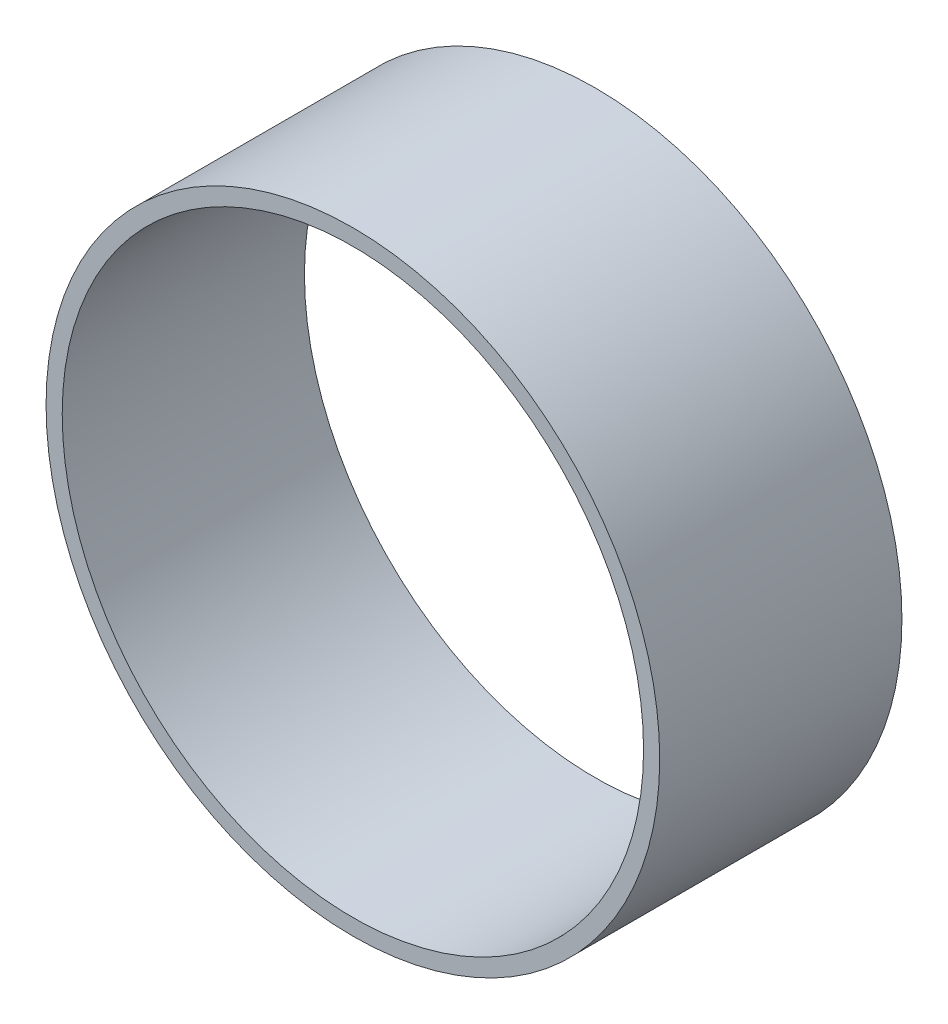
ISO-10303-21;
HEADER;
FILE_DESCRIPTION(('STEP AP214'),'2;1');
FILE_NAME('part.step','',(''),(''),'','','');
FILE_SCHEMA(('AUTOMOTIVE_DESIGN { 1 0 10303 214 1 1 1 1 }'));
ENDSEC;
DATA;
#1=APPLICATION_CONTEXT('core data for automotive mechanical design processes');
#2=APPLICATION_PROTOCOL_DEFINITION('international standard','automotive_design',2000,#1);
#3=PRODUCT_CONTEXT('',#1,'mechanical');
#4=PRODUCT('Part','Part','',(#3));
#5=PRODUCT_RELATED_PRODUCT_CATEGORY('part','',(#4));
#6=PRODUCT_DEFINITION_FORMATION('','',#4);
#7=PRODUCT_DEFINITION_CONTEXT('part definition',#1,'design');
#8=PRODUCT_DEFINITION('design','',#6,#7);
#9=PRODUCT_DEFINITION_SHAPE('','',#8);
#10=(LENGTH_UNIT() NAMED_UNIT(*) SI_UNIT(.MILLI.,.METRE.));
#11=(NAMED_UNIT(*) PLANE_ANGLE_UNIT() SI_UNIT($,.RADIAN.));
#12=(NAMED_UNIT(*) SI_UNIT($,.STERADIAN.) SOLID_ANGLE_UNIT());
#13=UNCERTAINTY_MEASURE_WITH_UNIT(LENGTH_MEASURE(1.E-05),#10,'distance_accuracy_value','');
#14=(GEOMETRIC_REPRESENTATION_CONTEXT(3) GLOBAL_UNCERTAINTY_ASSIGNED_CONTEXT((#13)) GLOBAL_UNIT_ASSIGNED_CONTEXT((#10,
#11,#12)) REPRESENTATION_CONTEXT('',''));
#15=CARTESIAN_POINT('',(0.,0.,0.));
#16=DIRECTION('',(0.,0.,1.));
#17=DIRECTION('',(1.,0.,0.));
#18=AXIS2_PLACEMENT_3D('',#15,#16,#17);
#19=CARTESIAN_POINT('',(0.,0.,150.));
#20=DIRECTION('',(0.,0.,1.));
#21=DIRECTION('',(1.,0.,0.));
#22=AXIS2_PLACEMENT_3D('',#19,#20,#21);
#23=PLANE('',#22);
#24=CARTESIAN_POINT('',(0.,0.,150.));
#25=DIRECTION('',(0.,0.,1.));
#26=DIRECTION('',(1.,0.,0.));
#27=AXIS2_PLACEMENT_3D('',#24,#25,#26);
#28=CIRCLE('',#27,190.);
#29=CARTESIAN_POINT('',(190.,0.,150.));
#30=VERTEX_POINT('',#29);
#31=EDGE_CURVE('E10',#30,#30,#28,.T.);
#32=ORIENTED_EDGE('',*,*,#31,.T.);
#33=EDGE_LOOP('',(#32));
#34=FACE_BOUND('',#33,.T.);
#35=CARTESIAN_POINT('',(0.,0.,150.));
#36=DIRECTION('',(0.,0.,1.));
#37=DIRECTION('',(1.,0.,0.));
#38=AXIS2_PLACEMENT_3D('',#35,#36,#37);
#39=CIRCLE('',#38,180.);
#40=CARTESIAN_POINT('',(180.,0.,150.));
#41=VERTEX_POINT('',#40);
#42=EDGE_CURVE('E47',#41,#41,#39,.T.);
#43=ORIENTED_EDGE('',*,*,#42,.F.);
#44=EDGE_LOOP('',(#43));
#45=FACE_BOUND('',#44,.T.);
#46=ADVANCED_FACE('F34',(#34,#45),#23,.T.);
#47=CARTESIAN_POINT('',(0.,0.,0.));
#48=DIRECTION('',(0.,0.,1.));
#49=DIRECTION('',(1.,0.,0.));
#50=AXIS2_PLACEMENT_3D('',#47,#48,#49);
#51=PLANE('',#50);
#52=CARTESIAN_POINT('',(0.,0.,0.));
#53=DIRECTION('',(0.,0.,1.));
#54=DIRECTION('',(1.,0.,0.));
#55=AXIS2_PLACEMENT_3D('',#52,#53,#54);
#56=CIRCLE('',#55,190.);
#57=CARTESIAN_POINT('',(190.,0.,0.));
#58=VERTEX_POINT('',#57);
#59=EDGE_CURVE('E38',#58,#58,#56,.T.);
#60=ORIENTED_EDGE('',*,*,#59,.F.);
#61=EDGE_LOOP('',(#60));
#62=FACE_BOUND('',#61,.T.);
#63=CARTESIAN_POINT('',(0.,0.,0.));
#64=DIRECTION('',(0.,0.,1.));
#65=DIRECTION('',(1.,0.,0.));
#66=AXIS2_PLACEMENT_3D('',#63,#64,#65);
#67=CIRCLE('',#66,180.);
#68=CARTESIAN_POINT('',(180.,0.,0.));
#69=VERTEX_POINT('',#68);
#70=EDGE_CURVE('E49',#69,#69,#67,.T.);
#71=ORIENTED_EDGE('',*,*,#70,.T.);
#72=EDGE_LOOP('',(#71));
#73=FACE_BOUND('',#72,.T.);
#74=ADVANCED_FACE('F61',(#62,#73),#51,.F.);
#75=CARTESIAN_POINT('',(0.,0.,150.));
#76=DIRECTION('',(0.,0.,-1.));
#77=DIRECTION('',(-1.,0.,0.));
#78=AXIS2_PLACEMENT_3D('',#75,#76,#77);
#79=CYLINDRICAL_SURFACE('',#78,190.);
#80=ORIENTED_EDGE('',*,*,#31,.F.);
#81=EDGE_LOOP('',(#80));
#82=FACE_BOUND('',#81,.T.);
#83=ORIENTED_EDGE('',*,*,#59,.T.);
#84=EDGE_LOOP('',(#83));
#85=FACE_BOUND('',#84,.T.);
#86=ADVANCED_FACE('F36',(#82,#85),#79,.T.);
#87=CARTESIAN_POINT('',(0.,0.,150.));
#88=DIRECTION('',(0.,0.,-1.));
#89=DIRECTION('',(-1.,0.,0.));
#90=AXIS2_PLACEMENT_3D('',#87,#88,#89);
#91=CYLINDRICAL_SURFACE('',#90,180.);
#92=ORIENTED_EDGE('',*,*,#42,.T.);
#93=EDGE_LOOP('',(#92));
#94=FACE_BOUND('',#93,.T.);
#95=ORIENTED_EDGE('',*,*,#70,.F.);
#96=EDGE_LOOP('',(#95));
#97=FACE_BOUND('',#96,.T.);
#98=ADVANCED_FACE('F57',(#94,#97),#91,.F.);
#99=CLOSED_SHELL('',(#46,#74,#86,#98));
#100=MANIFOLD_SOLID_BREP('B2',#99);
#101=ADVANCED_BREP_SHAPE_REPRESENTATION('',(#18,#100),#14);
#102=SHAPE_DEFINITION_REPRESENTATION(#9,#101);
ENDSEC;
END-ISO-10303-21;
